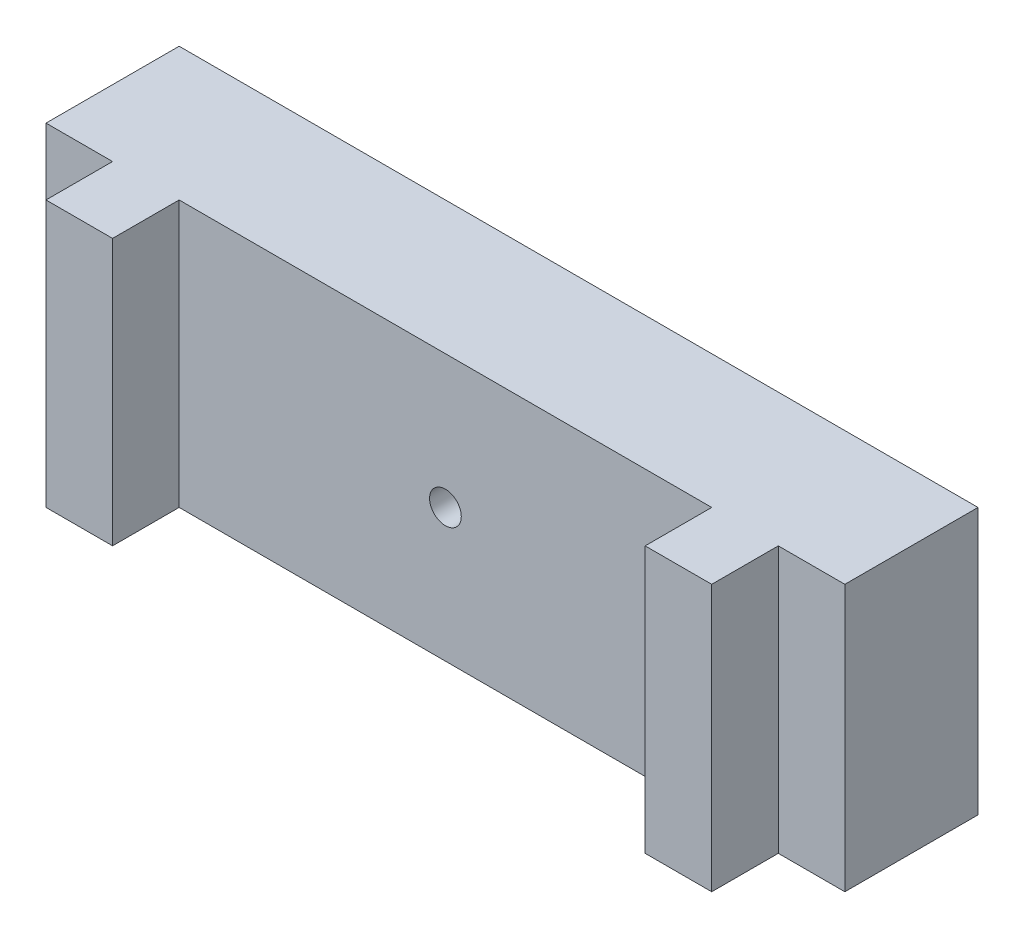
ISO-10303-21;
HEADER;
FILE_DESCRIPTION(('STEP AP214'),'2;1');
FILE_NAME('part.step','',(''),(''),'','','');
FILE_SCHEMA(('AUTOMOTIVE_DESIGN { 1 0 10303 214 1 1 1 1 }'));
ENDSEC;
DATA;
#1=APPLICATION_CONTEXT('core data for automotive mechanical design processes');
#2=APPLICATION_PROTOCOL_DEFINITION('international standard','automotive_design',2000,#1);
#3=PRODUCT_CONTEXT('',#1,'mechanical');
#4=PRODUCT('Part','Part','',(#3));
#5=PRODUCT_RELATED_PRODUCT_CATEGORY('part','',(#4));
#6=PRODUCT_DEFINITION_FORMATION('','',#4);
#7=PRODUCT_DEFINITION_CONTEXT('part definition',#1,'design');
#8=PRODUCT_DEFINITION('design','',#6,#7);
#9=PRODUCT_DEFINITION_SHAPE('','',#8);
#10=(LENGTH_UNIT() NAMED_UNIT(*) SI_UNIT(.MILLI.,.METRE.));
#11=(NAMED_UNIT(*) PLANE_ANGLE_UNIT() SI_UNIT($,.RADIAN.));
#12=(NAMED_UNIT(*) SI_UNIT($,.STERADIAN.) SOLID_ANGLE_UNIT());
#13=UNCERTAINTY_MEASURE_WITH_UNIT(LENGTH_MEASURE(1.E-05),#10,'distance_accuracy_value','');
#14=(GEOMETRIC_REPRESENTATION_CONTEXT(3) GLOBAL_UNCERTAINTY_ASSIGNED_CONTEXT((#13)) GLOBAL_UNIT_ASSIGNED_CONTEXT((#10,
#11,#12)) REPRESENTATION_CONTEXT('',''));
#15=CARTESIAN_POINT('',(0.,0.,0.));
#16=DIRECTION('',(0.,0.,1.));
#17=DIRECTION('',(1.,0.,0.));
#18=AXIS2_PLACEMENT_3D('',#15,#16,#17);
#19=CARTESIAN_POINT('',(0.,0.,6.35));
#20=DIRECTION('',(0.,0.,-1.));
#21=DIRECTION('',(-1.,0.,0.));
#22=AXIS2_PLACEMENT_3D('',#19,#20,#21);
#23=PLANE('',#22);
#24=DIRECTION('',(0.,1.,0.));
#25=VECTOR('',#24,1.);
#26=CARTESIAN_POINT('',(31.75,-12.7,6.35));
#27=LINE('',#26,#25);
#28=CARTESIAN_POINT('',(31.75,-12.7,6.35));
#29=VERTEX_POINT('',#28);
#30=CARTESIAN_POINT('',(31.75,12.7,6.35));
#31=VERTEX_POINT('',#30);
#32=EDGE_CURVE('E61',#29,#31,#27,.T.);
#33=ORIENTED_EDGE('',*,*,#32,.F.);
#34=DIRECTION('',(1.,0.,0.));
#35=VECTOR('',#34,1.);
#36=CARTESIAN_POINT('',(-38.1,-12.7,6.35));
#37=LINE('',#36,#35);
#38=CARTESIAN_POINT('',(38.1,-12.7,6.35));
#39=VERTEX_POINT('',#38);
#40=EDGE_CURVE('E221',#29,#39,#37,.T.);
#41=ORIENTED_EDGE('',*,*,#40,.T.);
#42=DIRECTION('',(0.,1.,0.));
#43=VECTOR('',#42,1.);
#44=CARTESIAN_POINT('',(38.1,-12.7,6.35));
#45=LINE('',#44,#43);
#46=CARTESIAN_POINT('',(38.1,12.7,6.35));
#47=VERTEX_POINT('',#46);
#48=EDGE_CURVE('E208',#39,#47,#45,.T.);
#49=ORIENTED_EDGE('',*,*,#48,.T.);
#50=DIRECTION('',(-1.,0.,0.));
#51=VECTOR('',#50,1.);
#52=CARTESIAN_POINT('',(-38.1,12.7,6.35));
#53=LINE('',#52,#51);
#54=EDGE_CURVE('E213',#47,#31,#53,.T.);
#55=ORIENTED_EDGE('',*,*,#54,.T.);
#56=EDGE_LOOP('',(#33,#41,#49,#55));
#57=FACE_BOUND('',#56,.T.);
#58=ADVANCED_FACE('F43',(#57),#23,.F.);
#59=CARTESIAN_POINT('',(0.,0.,6.35));
#60=DIRECTION('',(0.,0.,1.));
#61=DIRECTION('',(1.,0.,0.));
#62=AXIS2_PLACEMENT_3D('',#59,#60,#61);
#63=CIRCLE('',#62,1.5113);
#64=CARTESIAN_POINT('',(1.5113,0.,6.35));
#65=VERTEX_POINT('',#64);
#66=EDGE_CURVE('E295',#65,#65,#63,.T.);
#67=ORIENTED_EDGE('',*,*,#66,.F.);
#68=EDGE_LOOP('',(#67));
#69=FACE_BOUND('',#68,.T.);
#70=DIRECTION('',(0.,-1.,0.));
#71=VECTOR('',#70,1.);
#72=CARTESIAN_POINT('',(25.4,-12.7,6.35));
#73=LINE('',#72,#71);
#74=CARTESIAN_POINT('',(25.4,12.7,6.35));
#75=VERTEX_POINT('',#74);
#76=CARTESIAN_POINT('',(25.4,-12.7,6.35));
#77=VERTEX_POINT('',#76);
#78=EDGE_CURVE('E161',#75,#77,#73,.T.);
#79=ORIENTED_EDGE('',*,*,#78,.F.);
#80=CARTESIAN_POINT('',(-25.4,12.7,6.35));
#81=VERTEX_POINT('',#80);
#82=EDGE_CURVE('E217',#75,#81,#53,.T.);
#83=ORIENTED_EDGE('',*,*,#82,.T.);
#84=DIRECTION('',(0.,1.,0.));
#85=VECTOR('',#84,1.);
#86=CARTESIAN_POINT('',(-25.4,-12.7,6.35));
#87=LINE('',#86,#85);
#88=CARTESIAN_POINT('',(-25.4,-12.7,6.35));
#89=VERTEX_POINT('',#88);
#90=EDGE_CURVE('E165',#89,#81,#87,.T.);
#91=ORIENTED_EDGE('',*,*,#90,.F.);
#92=EDGE_CURVE('E69',#89,#77,#37,.T.);
#93=ORIENTED_EDGE('',*,*,#92,.T.);
#94=EDGE_LOOP('',(#79,#83,#91,#93));
#95=FACE_BOUND('',#94,.T.);
#96=ADVANCED_FACE('F272',(#69,#95),#23,.F.);
#97=DIRECTION('',(0.,-1.,0.));
#98=VECTOR('',#97,1.);
#99=CARTESIAN_POINT('',(-31.75,-12.7,6.35));
#100=LINE('',#99,#98);
#101=CARTESIAN_POINT('',(-31.75,12.7,6.35));
#102=VERTEX_POINT('',#101);
#103=CARTESIAN_POINT('',(-31.75,-12.7,6.35));
#104=VERTEX_POINT('',#103);
#105=EDGE_CURVE('E170',#102,#104,#100,.T.);
#106=ORIENTED_EDGE('',*,*,#105,.F.);
#107=CARTESIAN_POINT('',(-38.1,12.7,6.35));
#108=VERTEX_POINT('',#107);
#109=EDGE_CURVE('E212',#102,#108,#53,.T.);
#110=ORIENTED_EDGE('',*,*,#109,.T.);
#111=DIRECTION('',(0.,-1.,0.));
#112=VECTOR('',#111,1.);
#113=CARTESIAN_POINT('',(-38.1,-12.7,6.35));
#114=LINE('',#113,#112);
#115=CARTESIAN_POINT('',(-38.1,-12.7,6.35));
#116=VERTEX_POINT('',#115);
#117=EDGE_CURVE('E216',#108,#116,#114,.T.);
#118=ORIENTED_EDGE('',*,*,#117,.T.);
#119=EDGE_CURVE('E222',#116,#104,#37,.T.);
#120=ORIENTED_EDGE('',*,*,#119,.T.);
#121=EDGE_LOOP('',(#106,#110,#118,#120));
#122=FACE_BOUND('',#121,.T.);
#123=ADVANCED_FACE('F262',(#122),#23,.F.);
#124=CARTESIAN_POINT('',(38.1,-12.7,-6.35));
#125=DIRECTION('',(1.,0.,0.));
#126=DIRECTION('',(0.,0.,-1.));
#127=AXIS2_PLACEMENT_3D('',#124,#125,#126);
#128=PLANE('',#127);
#129=DIRECTION('',(0.,0.,1.));
#130=VECTOR('',#129,1.);
#131=CARTESIAN_POINT('',(38.1,12.7,-6.35));
#132=LINE('',#131,#130);
#133=CARTESIAN_POINT('',(38.1,12.7,-6.35));
#134=VERTEX_POINT('',#133);
#135=EDGE_CURVE('E47',#134,#47,#132,.T.);
#136=ORIENTED_EDGE('',*,*,#135,.T.);
#137=ORIENTED_EDGE('',*,*,#48,.F.);
#138=DIRECTION('',(0.,0.,1.));
#139=VECTOR('',#138,1.);
#140=CARTESIAN_POINT('',(38.1,-12.7,-6.35));
#141=LINE('',#140,#139);
#142=CARTESIAN_POINT('',(38.1,-12.7,-6.35));
#143=VERTEX_POINT('',#142);
#144=EDGE_CURVE('E11',#143,#39,#141,.T.);
#145=ORIENTED_EDGE('',*,*,#144,.F.);
#146=DIRECTION('',(0.,1.,0.));
#147=VECTOR('',#146,1.);
#148=CARTESIAN_POINT('',(38.1,-12.7,-6.35));
#149=LINE('',#148,#147);
#150=EDGE_CURVE('E225',#143,#134,#149,.T.);
#151=ORIENTED_EDGE('',*,*,#150,.T.);
#152=EDGE_LOOP('',(#136,#137,#145,#151));
#153=FACE_BOUND('',#152,.T.);
#154=ADVANCED_FACE('F45',(#153),#128,.T.);
#155=CARTESIAN_POINT('',(-38.1,-12.7,-6.35));
#156=DIRECTION('',(0.,-1.,0.));
#157=DIRECTION('',(0.,0.,-1.));
#158=AXIS2_PLACEMENT_3D('',#155,#156,#157);
#159=PLANE('',#158);
#160=ORIENTED_EDGE('',*,*,#144,.T.);
#161=ORIENTED_EDGE('',*,*,#40,.F.);
#162=DIRECTION('',(0.,0.,-1.));
#163=VECTOR('',#162,1.);
#164=CARTESIAN_POINT('',(31.75,-12.7,12.7));
#165=LINE('',#164,#163);
#166=CARTESIAN_POINT('',(31.75,-12.7,12.7));
#167=VERTEX_POINT('',#166);
#168=EDGE_CURVE('E282',#167,#29,#165,.T.);
#169=ORIENTED_EDGE('',*,*,#168,.F.);
#170=DIRECTION('',(1.,0.,0.));
#171=VECTOR('',#170,1.);
#172=CARTESIAN_POINT('',(25.4,-12.7,12.7));
#173=LINE('',#172,#171);
#174=CARTESIAN_POINT('',(25.4,-12.7,12.7));
#175=VERTEX_POINT('',#174);
#176=EDGE_CURVE('E156',#175,#167,#173,.T.);
#177=ORIENTED_EDGE('',*,*,#176,.F.);
#178=DIRECTION('',(0.,0.,-1.));
#179=VECTOR('',#178,1.);
#180=CARTESIAN_POINT('',(25.4,-12.7,12.7));
#181=LINE('',#180,#179);
#182=EDGE_CURVE('E172',#175,#77,#181,.T.);
#183=ORIENTED_EDGE('',*,*,#182,.T.);
#184=ORIENTED_EDGE('',*,*,#92,.F.);
#185=DIRECTION('',(0.,0.,-1.));
#186=VECTOR('',#185,1.);
#187=CARTESIAN_POINT('',(-25.4,-12.7,12.7));
#188=LINE('',#187,#186);
#189=CARTESIAN_POINT('',(-25.4,-12.7,12.7));
#190=VERTEX_POINT('',#189);
#191=EDGE_CURVE('E188',#190,#89,#188,.T.);
#192=ORIENTED_EDGE('',*,*,#191,.F.);
#193=DIRECTION('',(1.,0.,0.));
#194=VECTOR('',#193,1.);
#195=CARTESIAN_POINT('',(-31.75,-12.7,12.7));
#196=LINE('',#195,#194);
#197=CARTESIAN_POINT('',(-31.75,-12.7,12.7));
#198=VERTEX_POINT('',#197);
#199=EDGE_CURVE('E186',#198,#190,#196,.T.);
#200=ORIENTED_EDGE('',*,*,#199,.F.);
#201=DIRECTION('',(0.,0.,-1.));
#202=VECTOR('',#201,1.);
#203=CARTESIAN_POINT('',(-31.75,-12.7,12.7));
#204=LINE('',#203,#202);
#205=EDGE_CURVE('E196',#198,#104,#204,.T.);
#206=ORIENTED_EDGE('',*,*,#205,.T.);
#207=ORIENTED_EDGE('',*,*,#119,.F.);
#208=DIRECTION('',(0.,0.,1.));
#209=VECTOR('',#208,1.);
#210=CARTESIAN_POINT('',(-38.1,-12.7,-6.35));
#211=LINE('',#210,#209);
#212=CARTESIAN_POINT('',(-38.1,-12.7,-6.35));
#213=VERTEX_POINT('',#212);
#214=EDGE_CURVE('E53',#213,#116,#211,.T.);
#215=ORIENTED_EDGE('',*,*,#214,.F.);
#216=DIRECTION('',(1.,0.,0.));
#217=VECTOR('',#216,1.);
#218=CARTESIAN_POINT('',(-38.1,-12.7,-6.35));
#219=LINE('',#218,#217);
#220=EDGE_CURVE('E237',#213,#143,#219,.T.);
#221=ORIENTED_EDGE('',*,*,#220,.T.);
#222=EDGE_LOOP('',(#160,#161,#169,#177,#183,#184,#192,#200,#206,#207,#215,#221));
#223=FACE_BOUND('',#222,.T.);
#224=ADVANCED_FACE('F253',(#223),#159,.T.);
#225=CARTESIAN_POINT('',(-38.1,-12.7,-6.35));
#226=DIRECTION('',(-1.,0.,0.));
#227=DIRECTION('',(0.,0.,1.));
#228=AXIS2_PLACEMENT_3D('',#225,#226,#227);
#229=PLANE('',#228);
#230=ORIENTED_EDGE('',*,*,#214,.T.);
#231=ORIENTED_EDGE('',*,*,#117,.F.);
#232=DIRECTION('',(0.,0.,1.));
#233=VECTOR('',#232,1.);
#234=CARTESIAN_POINT('',(-38.1,12.7,-6.35));
#235=LINE('',#234,#233);
#236=CARTESIAN_POINT('',(-38.1,12.7,-6.35));
#237=VERTEX_POINT('',#236);
#238=EDGE_CURVE('E242',#237,#108,#235,.T.);
#239=ORIENTED_EDGE('',*,*,#238,.F.);
#240=DIRECTION('',(0.,-1.,0.));
#241=VECTOR('',#240,1.);
#242=CARTESIAN_POINT('',(-38.1,-12.7,-6.35));
#243=LINE('',#242,#241);
#244=EDGE_CURVE('E233',#237,#213,#243,.T.);
#245=ORIENTED_EDGE('',*,*,#244,.T.);
#246=EDGE_LOOP('',(#230,#231,#239,#245));
#247=FACE_BOUND('',#246,.T.);
#248=ADVANCED_FACE('F259',(#247),#229,.T.);
#249=CARTESIAN_POINT('',(-38.1,12.7,-6.35));
#250=DIRECTION('',(0.,1.,0.));
#251=DIRECTION('',(0.,0.,1.));
#252=AXIS2_PLACEMENT_3D('',#249,#250,#251);
#253=PLANE('',#252);
#254=ORIENTED_EDGE('',*,*,#238,.T.);
#255=ORIENTED_EDGE('',*,*,#109,.F.);
#256=DIRECTION('',(0.,0.,-1.));
#257=VECTOR('',#256,1.);
#258=CARTESIAN_POINT('',(-31.75,12.7,12.7));
#259=LINE('',#258,#257);
#260=CARTESIAN_POINT('',(-31.75,12.7,12.7));
#261=VERTEX_POINT('',#260);
#262=EDGE_CURVE('E200',#261,#102,#259,.T.);
#263=ORIENTED_EDGE('',*,*,#262,.F.);
#264=DIRECTION('',(-1.,0.,0.));
#265=VECTOR('',#264,1.);
#266=CARTESIAN_POINT('',(-31.75,12.7,12.7));
#267=LINE('',#266,#265);
#268=CARTESIAN_POINT('',(-25.4,12.7,12.7));
#269=VERTEX_POINT('',#268);
#270=EDGE_CURVE('E180',#269,#261,#267,.T.);
#271=ORIENTED_EDGE('',*,*,#270,.F.);
#272=DIRECTION('',(0.,0.,-1.));
#273=VECTOR('',#272,1.);
#274=CARTESIAN_POINT('',(-25.4,12.7,12.7));
#275=LINE('',#274,#273);
#276=EDGE_CURVE('E204',#269,#81,#275,.T.);
#277=ORIENTED_EDGE('',*,*,#276,.T.);
#278=ORIENTED_EDGE('',*,*,#82,.F.);
#279=DIRECTION('',(0.,0.,-1.));
#280=VECTOR('',#279,1.);
#281=CARTESIAN_POINT('',(25.4,12.7,12.7));
#282=LINE('',#281,#280);
#283=CARTESIAN_POINT('',(25.4,12.7,12.7));
#284=VERTEX_POINT('',#283);
#285=EDGE_CURVE('E146',#284,#75,#282,.T.);
#286=ORIENTED_EDGE('',*,*,#285,.F.);
#287=DIRECTION('',(-1.,0.,0.));
#288=VECTOR('',#287,1.);
#289=CARTESIAN_POINT('',(25.4,12.7,12.7));
#290=LINE('',#289,#288);
#291=CARTESIAN_POINT('',(31.75,12.7,12.7));
#292=VERTEX_POINT('',#291);
#293=EDGE_CURVE('E138',#292,#284,#290,.T.);
#294=ORIENTED_EDGE('',*,*,#293,.F.);
#295=DIRECTION('',(0.,0.,-1.));
#296=VECTOR('',#295,1.);
#297=CARTESIAN_POINT('',(31.75,12.7,12.7));
#298=LINE('',#297,#296);
#299=EDGE_CURVE('E144',#292,#31,#298,.T.);
#300=ORIENTED_EDGE('',*,*,#299,.T.);
#301=ORIENTED_EDGE('',*,*,#54,.F.);
#302=ORIENTED_EDGE('',*,*,#135,.F.);
#303=DIRECTION('',(-1.,0.,0.));
#304=VECTOR('',#303,1.);
#305=CARTESIAN_POINT('',(-38.1,12.7,-6.35));
#306=LINE('',#305,#304);
#307=EDGE_CURVE('E229',#134,#237,#306,.T.);
#308=ORIENTED_EDGE('',*,*,#307,.T.);
#309=EDGE_LOOP('',(#254,#255,#263,#271,#277,#278,#286,#294,#300,#301,#302,#308));
#310=FACE_BOUND('',#309,.T.);
#311=ADVANCED_FACE('F141',(#310),#253,.T.);
#312=CARTESIAN_POINT('',(0.,0.,-6.35));
#313=DIRECTION('',(0.,0.,-1.));
#314=DIRECTION('',(-1.,0.,0.));
#315=AXIS2_PLACEMENT_3D('',#312,#313,#314);
#316=PLANE('',#315);
#317=CARTESIAN_POINT('',(0.,0.,-6.35));
#318=DIRECTION('',(0.,0.,1.));
#319=DIRECTION('',(1.,0.,0.));
#320=AXIS2_PLACEMENT_3D('',#317,#318,#319);
#321=CIRCLE('',#320,1.5113);
#322=CARTESIAN_POINT('',(1.5113,0.,-6.35));
#323=VERTEX_POINT('',#322);
#324=EDGE_CURVE('E290',#323,#323,#321,.T.);
#325=ORIENTED_EDGE('',*,*,#324,.T.);
#326=EDGE_LOOP('',(#325));
#327=FACE_BOUND('',#326,.T.);
#328=ORIENTED_EDGE('',*,*,#150,.F.);
#329=ORIENTED_EDGE('',*,*,#220,.F.);
#330=ORIENTED_EDGE('',*,*,#244,.F.);
#331=ORIENTED_EDGE('',*,*,#307,.F.);
#332=EDGE_LOOP('',(#328,#329,#330,#331));
#333=FACE_BOUND('',#332,.T.);
#334=ADVANCED_FACE('F256',(#327,#333),#316,.T.);
#335=CARTESIAN_POINT('',(-25.4,-12.7,12.7));
#336=DIRECTION('',(-1.,0.,0.));
#337=DIRECTION('',(0.,0.,1.));
#338=AXIS2_PLACEMENT_3D('',#335,#336,#337);
#339=PLANE('',#338);
#340=ORIENTED_EDGE('',*,*,#90,.T.);
#341=ORIENTED_EDGE('',*,*,#276,.F.);
#342=DIRECTION('',(0.,1.,0.));
#343=VECTOR('',#342,1.);
#344=CARTESIAN_POINT('',(-25.4,-12.7,12.7));
#345=LINE('',#344,#343);
#346=EDGE_CURVE('E176',#190,#269,#345,.T.);
#347=ORIENTED_EDGE('',*,*,#346,.F.);
#348=ORIENTED_EDGE('',*,*,#191,.T.);
#349=EDGE_LOOP('',(#340,#341,#347,#348));
#350=FACE_BOUND('',#349,.T.);
#351=ADVANCED_FACE('F276',(#350),#339,.F.);
#352=CARTESIAN_POINT('',(-31.75,-12.7,12.7));
#353=DIRECTION('',(1.,0.,0.));
#354=DIRECTION('',(0.,0.,-1.));
#355=AXIS2_PLACEMENT_3D('',#352,#353,#354);
#356=PLANE('',#355);
#357=ORIENTED_EDGE('',*,*,#105,.T.);
#358=ORIENTED_EDGE('',*,*,#205,.F.);
#359=DIRECTION('',(0.,-1.,0.));
#360=VECTOR('',#359,1.);
#361=CARTESIAN_POINT('',(-31.75,-12.7,12.7));
#362=LINE('',#361,#360);
#363=EDGE_CURVE('E183',#261,#198,#362,.T.);
#364=ORIENTED_EDGE('',*,*,#363,.F.);
#365=ORIENTED_EDGE('',*,*,#262,.T.);
#366=EDGE_LOOP('',(#357,#358,#364,#365));
#367=FACE_BOUND('',#366,.T.);
#368=ADVANCED_FACE('F268',(#367),#356,.F.);
#369=CARTESIAN_POINT('',(0.,0.,12.7));
#370=DIRECTION('',(0.,0.,-1.));
#371=DIRECTION('',(-1.,0.,0.));
#372=AXIS2_PLACEMENT_3D('',#369,#370,#371);
#373=PLANE('',#372);
#374=ORIENTED_EDGE('',*,*,#346,.T.);
#375=ORIENTED_EDGE('',*,*,#270,.T.);
#376=ORIENTED_EDGE('',*,*,#363,.T.);
#377=ORIENTED_EDGE('',*,*,#199,.T.);
#378=EDGE_LOOP('',(#374,#375,#376,#377));
#379=FACE_BOUND('',#378,.T.);
#380=ADVANCED_FACE('F345',(#379),#373,.F.);
#381=CARTESIAN_POINT('',(31.75,-12.7,12.7));
#382=DIRECTION('',(-1.,0.,0.));
#383=DIRECTION('',(0.,0.,1.));
#384=AXIS2_PLACEMENT_3D('',#381,#382,#383);
#385=PLANE('',#384);
#386=ORIENTED_EDGE('',*,*,#32,.T.);
#387=ORIENTED_EDGE('',*,*,#299,.F.);
#388=DIRECTION('',(0.,1.,0.));
#389=VECTOR('',#388,1.);
#390=CARTESIAN_POINT('',(31.75,-12.7,12.7));
#391=LINE('',#390,#389);
#392=EDGE_CURVE('E151',#167,#292,#391,.T.);
#393=ORIENTED_EDGE('',*,*,#392,.F.);
#394=ORIENTED_EDGE('',*,*,#168,.T.);
#395=EDGE_LOOP('',(#386,#387,#393,#394));
#396=FACE_BOUND('',#395,.T.);
#397=ADVANCED_FACE('F163',(#396),#385,.F.);
#398=CARTESIAN_POINT('',(25.4,-12.7,12.7));
#399=DIRECTION('',(1.,0.,0.));
#400=DIRECTION('',(0.,0.,-1.));
#401=AXIS2_PLACEMENT_3D('',#398,#399,#400);
#402=PLANE('',#401);
#403=ORIENTED_EDGE('',*,*,#78,.T.);
#404=ORIENTED_EDGE('',*,*,#182,.F.);
#405=DIRECTION('',(0.,-1.,0.));
#406=VECTOR('',#405,1.);
#407=CARTESIAN_POINT('',(25.4,-12.7,12.7));
#408=LINE('',#407,#406);
#409=EDGE_CURVE('E150',#284,#175,#408,.T.);
#410=ORIENTED_EDGE('',*,*,#409,.F.);
#411=ORIENTED_EDGE('',*,*,#285,.T.);
#412=EDGE_LOOP('',(#403,#404,#410,#411));
#413=FACE_BOUND('',#412,.T.);
#414=ADVANCED_FACE('F358',(#413),#402,.F.);
#415=CARTESIAN_POINT('',(0.,0.,12.7));
#416=DIRECTION('',(0.,0.,-1.));
#417=DIRECTION('',(-1.,0.,0.));
#418=AXIS2_PLACEMENT_3D('',#415,#416,#417);
#419=PLANE('',#418);
#420=ORIENTED_EDGE('',*,*,#392,.T.);
#421=ORIENTED_EDGE('',*,*,#293,.T.);
#422=ORIENTED_EDGE('',*,*,#409,.T.);
#423=ORIENTED_EDGE('',*,*,#176,.T.);
#424=EDGE_LOOP('',(#420,#421,#422,#423));
#425=FACE_BOUND('',#424,.T.);
#426=ADVANCED_FACE('F154',(#425),#419,.F.);
#427=CARTESIAN_POINT('',(0.,0.,-6.35));
#428=DIRECTION('',(0.,0.,1.));
#429=DIRECTION('',(1.,0.,0.));
#430=AXIS2_PLACEMENT_3D('',#427,#428,#429);
#431=CYLINDRICAL_SURFACE('',#430,1.5113);
#432=ORIENTED_EDGE('',*,*,#324,.F.);
#433=EDGE_LOOP('',(#432));
#434=FACE_BOUND('',#433,.T.);
#435=ORIENTED_EDGE('',*,*,#66,.T.);
#436=EDGE_LOOP('',(#435));
#437=FACE_BOUND('',#436,.T.);
#438=ADVANCED_FACE('F304',(#434,#437),#431,.F.);
#439=CLOSED_SHELL('',(#58,#96,#123,#154,#224,#248,#311,#334,#351,#368,#380,#397,#414,#426,#438));
#440=MANIFOLD_SOLID_BREP('B2',#439);
#441=ADVANCED_BREP_SHAPE_REPRESENTATION('',(#18,#440),#14);
#442=SHAPE_DEFINITION_REPRESENTATION(#9,#441);
ENDSEC;
END-ISO-10303-21;
